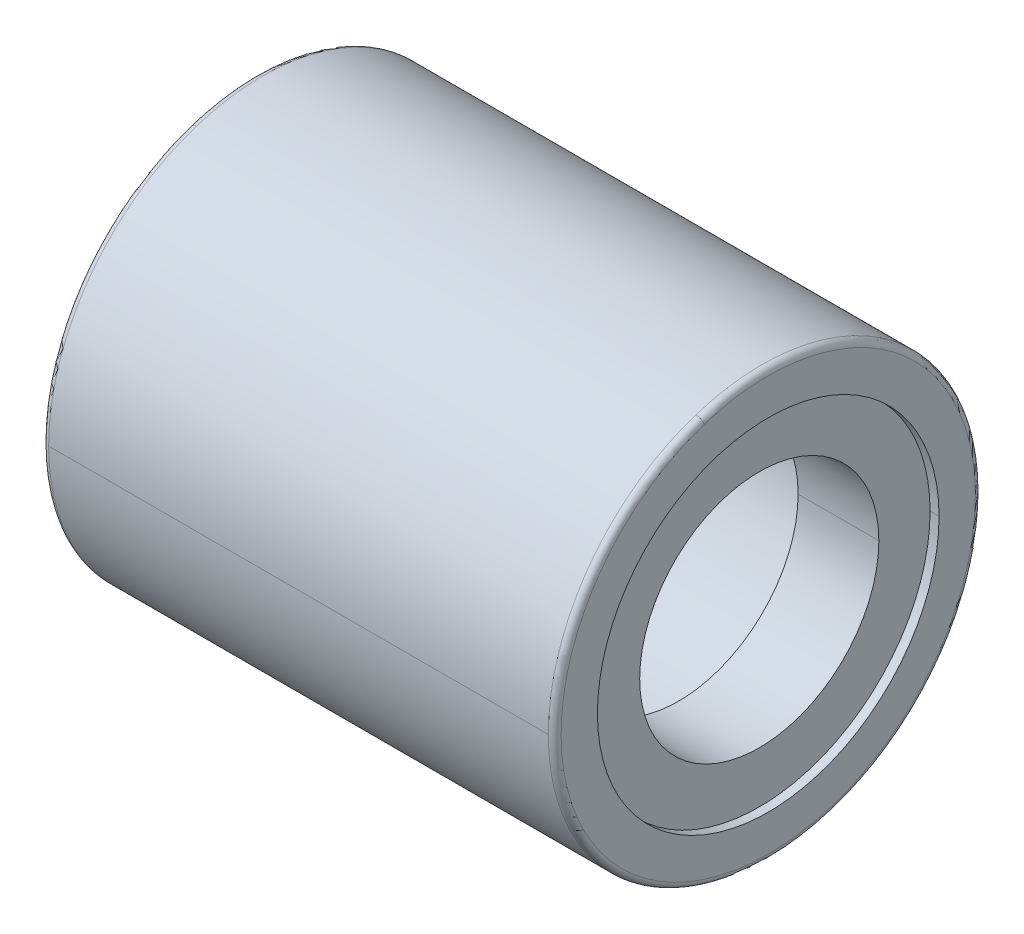
ISO-10303-21;
HEADER;
FILE_DESCRIPTION(('STEP AP214'),'2;1');
FILE_NAME('part.step','',(''),(''),'','','');
FILE_SCHEMA(('AUTOMOTIVE_DESIGN { 1 0 10303 214 1 1 1 1 }'));
ENDSEC;
DATA;
#1=APPLICATION_CONTEXT('core data for automotive mechanical design processes');
#2=APPLICATION_PROTOCOL_DEFINITION('international standard','automotive_design',2000,#1);
#3=PRODUCT_CONTEXT('',#1,'mechanical');
#4=PRODUCT('Part','Part','',(#3));
#5=PRODUCT_RELATED_PRODUCT_CATEGORY('part','',(#4));
#6=PRODUCT_DEFINITION_FORMATION('','',#4);
#7=PRODUCT_DEFINITION_CONTEXT('part definition',#1,'design');
#8=PRODUCT_DEFINITION('design','',#6,#7);
#9=PRODUCT_DEFINITION_SHAPE('','',#8);
#10=(LENGTH_UNIT() NAMED_UNIT(*) SI_UNIT(.MILLI.,.METRE.));
#11=(NAMED_UNIT(*) PLANE_ANGLE_UNIT() SI_UNIT($,.RADIAN.));
#12=(NAMED_UNIT(*) SI_UNIT($,.STERADIAN.) SOLID_ANGLE_UNIT());
#13=UNCERTAINTY_MEASURE_WITH_UNIT(LENGTH_MEASURE(1.E-05),#10,'distance_accuracy_value','');
#14=(GEOMETRIC_REPRESENTATION_CONTEXT(3) GLOBAL_UNCERTAINTY_ASSIGNED_CONTEXT((#13)) GLOBAL_UNIT_ASSIGNED_CONTEXT((#10,
#11,#12)) REPRESENTATION_CONTEXT('',''));
#15=CARTESIAN_POINT('',(0.,0.,0.));
#16=DIRECTION('',(0.,0.,1.));
#17=DIRECTION('',(1.,0.,0.));
#18=AXIS2_PLACEMENT_3D('',#15,#16,#17);
#19=CARTESIAN_POINT('',(50.,0.,0.));
#20=DIRECTION('',(1.,0.,0.));
#21=DIRECTION('',(0.,1.,0.));
#22=AXIS2_PLACEMENT_3D('',#19,#20,#21);
#23=CYLINDRICAL_SURFACE('',#22,4.);
#24=DIRECTION('',(1.,0.,0.));
#25=VECTOR('',#24,1.);
#26=CARTESIAN_POINT('',(2.1,0.,4.));
#27=LINE('',#26,#25);
#28=CARTESIAN_POINT('',(2.1,0.,4.));
#29=VERTEX_POINT('',#28);
#30=CARTESIAN_POINT('',(9.9,0.,4.));
#31=VERTEX_POINT('',#30);
#32=EDGE_CURVE('E10',#29,#31,#27,.T.);
#33=ORIENTED_EDGE('',*,*,#32,.T.);
#34=CARTESIAN_POINT('',(9.9,0.,0.));
#35=DIRECTION('',(1.,0.,0.));
#36=DIRECTION('',(0.,0.,-1.));
#37=AXIS2_PLACEMENT_3D('',#34,#35,#36);
#38=CIRCLE('',#37,4.);
#39=CARTESIAN_POINT('',(9.9,0.,-4.));
#40=VERTEX_POINT('',#39);
#41=EDGE_CURVE('E24',#31,#40,#38,.T.);
#42=ORIENTED_EDGE('',*,*,#41,.T.);
#43=DIRECTION('',(1.,0.,0.));
#44=VECTOR('',#43,1.);
#45=CARTESIAN_POINT('',(2.1,0.,-4.));
#46=LINE('',#45,#44);
#47=CARTESIAN_POINT('',(2.1,0.,-4.));
#48=VERTEX_POINT('',#47);
#49=EDGE_CURVE('E432',#48,#40,#46,.T.);
#50=ORIENTED_EDGE('',*,*,#49,.F.);
#51=CARTESIAN_POINT('',(2.1,0.,0.));
#52=DIRECTION('',(1.,0.,0.));
#53=DIRECTION('',(0.,0.,-1.));
#54=AXIS2_PLACEMENT_3D('',#51,#52,#53);
#55=CIRCLE('',#54,4.);
#56=EDGE_CURVE('E427',#29,#48,#55,.T.);
#57=ORIENTED_EDGE('',*,*,#56,.F.);
#58=EDGE_LOOP('',(#33,#42,#50,#57));
#59=FACE_BOUND('',#58,.T.);
#60=ADVANCED_FACE('F16',(#59),#23,.F.);
#61=CARTESIAN_POINT('',(2.1,2.8,0.));
#62=DIRECTION('',(1.,0.,0.));
#63=DIRECTION('',(0.,0.,-1.));
#64=AXIS2_PLACEMENT_3D('',#61,#62,#63);
#65=PLANE('',#64);
#66=CARTESIAN_POINT('',(2.1,0.,0.));
#67=DIRECTION('',(1.,0.,0.));
#68=DIRECTION('',(0.,0.,-1.));
#69=AXIS2_PLACEMENT_3D('',#66,#67,#68);
#70=CIRCLE('',#69,4.);
#71=EDGE_CURVE('E422',#48,#29,#70,.T.);
#72=ORIENTED_EDGE('',*,*,#71,.T.);
#73=ORIENTED_EDGE('',*,*,#56,.T.);
#74=EDGE_LOOP('',(#72,#73));
#75=FACE_BOUND('',#74,.T.);
#76=CARTESIAN_POINT('',(2.1,0.,0.));
#77=DIRECTION('',(1.,0.,0.));
#78=DIRECTION('',(0.,0.,-1.));
#79=AXIS2_PLACEMENT_3D('',#76,#77,#78);
#80=CIRCLE('',#79,2.8);
#81=CARTESIAN_POINT('',(2.1,0.,2.8));
#82=VERTEX_POINT('',#81);
#83=CARTESIAN_POINT('',(2.1,0.,-2.8));
#84=VERTEX_POINT('',#83);
#85=EDGE_CURVE('E417',#82,#84,#80,.T.);
#86=ORIENTED_EDGE('',*,*,#85,.F.);
#87=CARTESIAN_POINT('',(2.1,0.,0.));
#88=DIRECTION('',(1.,0.,0.));
#89=DIRECTION('',(0.,0.,-1.));
#90=AXIS2_PLACEMENT_3D('',#87,#88,#89);
#91=CIRCLE('',#90,2.8);
#92=EDGE_CURVE('E412',#84,#82,#91,.T.);
#93=ORIENTED_EDGE('',*,*,#92,.F.);
#94=EDGE_LOOP('',(#86,#93));
#95=FACE_BOUND('',#94,.T.);
#96=ADVANCED_FACE('F445',(#75,#95),#65,.T.);
#97=CARTESIAN_POINT('',(50.,0.,0.));
#98=DIRECTION('',(1.,0.,0.));
#99=DIRECTION('',(0.,-1.,0.));
#100=AXIS2_PLACEMENT_3D('',#97,#98,#99);
#101=CYLINDRICAL_SURFACE('',#100,2.8);
#102=DIRECTION('',(1.,0.,0.));
#103=VECTOR('',#102,1.);
#104=CARTESIAN_POINT('',(0.210000000000001,0.,2.8));
#105=LINE('',#104,#103);
#106=CARTESIAN_POINT('',(0.210000000000001,0.,2.8));
#107=VERTEX_POINT('',#106);
#108=EDGE_CURVE('E407',#107,#82,#105,.T.);
#109=ORIENTED_EDGE('',*,*,#108,.F.);
#110=CARTESIAN_POINT('',(0.21,0.,0.));
#111=DIRECTION('',(1.,0.,0.));
#112=DIRECTION('',(0.,0.,-1.));
#113=AXIS2_PLACEMENT_3D('',#110,#111,#112);
#114=CIRCLE('',#113,2.8);
#115=CARTESIAN_POINT('',(0.21,0.,-2.8));
#116=VERTEX_POINT('',#115);
#117=EDGE_CURVE('E402',#116,#107,#114,.T.);
#118=ORIENTED_EDGE('',*,*,#117,.F.);
#119=DIRECTION('',(1.,0.,0.));
#120=VECTOR('',#119,1.);
#121=CARTESIAN_POINT('',(0.210000000000001,0.,-2.8));
#122=LINE('',#121,#120);
#123=EDGE_CURVE('E397',#116,#84,#122,.T.);
#124=ORIENTED_EDGE('',*,*,#123,.T.);
#125=ORIENTED_EDGE('',*,*,#92,.T.);
#126=EDGE_LOOP('',(#109,#118,#124,#125));
#127=FACE_BOUND('',#126,.T.);
#128=ADVANCED_FACE('F448',(#127),#101,.F.);
#129=CARTESIAN_POINT('',(50.,0.,0.));
#130=DIRECTION('',(1.,0.,0.));
#131=DIRECTION('',(0.,1.,0.));
#132=AXIS2_PLACEMENT_3D('',#129,#130,#131);
#133=CYLINDRICAL_SURFACE('',#132,2.8);
#134=ORIENTED_EDGE('',*,*,#108,.T.);
#135=ORIENTED_EDGE('',*,*,#85,.T.);
#136=ORIENTED_EDGE('',*,*,#123,.F.);
#137=CARTESIAN_POINT('',(0.21,0.,0.));
#138=DIRECTION('',(1.,0.,0.));
#139=DIRECTION('',(0.,0.,-1.));
#140=AXIS2_PLACEMENT_3D('',#137,#138,#139);
#141=CIRCLE('',#140,2.8);
#142=EDGE_CURVE('E392',#107,#116,#141,.T.);
#143=ORIENTED_EDGE('',*,*,#142,.F.);
#144=EDGE_LOOP('',(#134,#135,#136,#143));
#145=FACE_BOUND('',#144,.T.);
#146=ADVANCED_FACE('F452',(#145),#133,.F.);
#147=CARTESIAN_POINT('',(0.21,4.,0.));
#148=DIRECTION('',(-1.,0.,0.));
#149=DIRECTION('',(0.,0.,1.));
#150=AXIS2_PLACEMENT_3D('',#147,#148,#149);
#151=PLANE('',#150);
#152=ORIENTED_EDGE('',*,*,#117,.T.);
#153=ORIENTED_EDGE('',*,*,#142,.T.);
#154=EDGE_LOOP('',(#152,#153));
#155=FACE_BOUND('',#154,.T.);
#156=CARTESIAN_POINT('',(0.21,0.,0.));
#157=DIRECTION('',(1.,0.,0.));
#158=DIRECTION('',(0.,0.,-1.));
#159=AXIS2_PLACEMENT_3D('',#156,#157,#158);
#160=CIRCLE('',#159,4.);
#161=CARTESIAN_POINT('',(0.210000000000001,0.,4.));
#162=VERTEX_POINT('',#161);
#163=CARTESIAN_POINT('',(0.21,0.,-4.));
#164=VERTEX_POINT('',#163);
#165=EDGE_CURVE('E387',#162,#164,#160,.T.);
#166=ORIENTED_EDGE('',*,*,#165,.F.);
#167=CARTESIAN_POINT('',(0.21,0.,0.));
#168=DIRECTION('',(1.,0.,0.));
#169=DIRECTION('',(0.,0.,-1.));
#170=AXIS2_PLACEMENT_3D('',#167,#168,#169);
#171=CIRCLE('',#170,4.);
#172=EDGE_CURVE('E382',#164,#162,#171,.T.);
#173=ORIENTED_EDGE('',*,*,#172,.F.);
#174=EDGE_LOOP('',(#166,#173));
#175=FACE_BOUND('',#174,.T.);
#176=ADVANCED_FACE('F455',(#155,#175),#151,.T.);
#177=CARTESIAN_POINT('',(50.,0.,0.));
#178=DIRECTION('',(1.,0.,0.));
#179=DIRECTION('',(0.,-1.,0.));
#180=AXIS2_PLACEMENT_3D('',#177,#178,#179);
#181=CYLINDRICAL_SURFACE('',#180,4.);
#182=DIRECTION('',(1.,0.,0.));
#183=VECTOR('',#182,1.);
#184=CARTESIAN_POINT('',(0.,0.,4.));
#185=LINE('',#184,#183);
#186=CARTESIAN_POINT('',(0.,0.,4.));
#187=VERTEX_POINT('',#186);
#188=EDGE_CURVE('E377',#187,#162,#185,.T.);
#189=ORIENTED_EDGE('',*,*,#188,.F.);
#190=CARTESIAN_POINT('',(0.,0.,0.));
#191=DIRECTION('',(1.,0.,0.));
#192=DIRECTION('',(0.,0.,-1.));
#193=AXIS2_PLACEMENT_3D('',#190,#191,#192);
#194=CIRCLE('',#193,4.);
#195=CARTESIAN_POINT('',(0.,0.,-4.));
#196=VERTEX_POINT('',#195);
#197=EDGE_CURVE('E372',#196,#187,#194,.T.);
#198=ORIENTED_EDGE('',*,*,#197,.F.);
#199=DIRECTION('',(1.,0.,0.));
#200=VECTOR('',#199,1.);
#201=CARTESIAN_POINT('',(0.,0.,-4.));
#202=LINE('',#201,#200);
#203=EDGE_CURVE('E367',#196,#164,#202,.T.);
#204=ORIENTED_EDGE('',*,*,#203,.T.);
#205=ORIENTED_EDGE('',*,*,#172,.T.);
#206=EDGE_LOOP('',(#189,#198,#204,#205));
#207=FACE_BOUND('',#206,.T.);
#208=ADVANCED_FACE('F458',(#207),#181,.F.);
#209=CARTESIAN_POINT('',(50.,0.,0.));
#210=DIRECTION('',(1.,0.,0.));
#211=DIRECTION('',(0.,1.,0.));
#212=AXIS2_PLACEMENT_3D('',#209,#210,#211);
#213=CYLINDRICAL_SURFACE('',#212,4.);
#214=ORIENTED_EDGE('',*,*,#188,.T.);
#215=ORIENTED_EDGE('',*,*,#165,.T.);
#216=ORIENTED_EDGE('',*,*,#203,.F.);
#217=CARTESIAN_POINT('',(0.,0.,0.));
#218=DIRECTION('',(1.,0.,0.));
#219=DIRECTION('',(0.,0.,-1.));
#220=AXIS2_PLACEMENT_3D('',#217,#218,#219);
#221=CIRCLE('',#220,4.);
#222=EDGE_CURVE('E364',#187,#196,#221,.T.);
#223=ORIENTED_EDGE('',*,*,#222,.F.);
#224=EDGE_LOOP('',(#214,#215,#216,#223));
#225=FACE_BOUND('',#224,.T.);
#226=ADVANCED_FACE('F463',(#225),#213,.F.);
#227=CARTESIAN_POINT('',(0.,4.85,0.));
#228=DIRECTION('',(-1.,0.,0.));
#229=DIRECTION('',(0.,0.,1.));
#230=AXIS2_PLACEMENT_3D('',#227,#228,#229);
#231=PLANE('',#230);
#232=ORIENTED_EDGE('',*,*,#197,.T.);
#233=ORIENTED_EDGE('',*,*,#222,.T.);
#234=EDGE_LOOP('',(#232,#233));
#235=FACE_BOUND('',#234,.T.);
#236=CARTESIAN_POINT('',(0.,-4.61262410403149,-1.49873242271851));
#237=CARTESIAN_POINT('',(0.,-4.58810272833592,-1.57420690453958));
#238=CARTESIAN_POINT('',(0.,-4.5617258440753,-1.64907834447075));
#239=CARTESIAN_POINT('',(0.,-4.50533151965913,-1.79743739794931));
#240=CARTESIAN_POINT('',(0.,-4.47531407950357,-1.87092501149671));
#241=CARTESIAN_POINT('',(0.,-4.41170910453264,-2.01633866960378));
#242=CARTESIAN_POINT('',(0.,-4.37812156971728,-2.08826471416345));
#243=CARTESIAN_POINT('',(0.,-4.30745781735907,-2.23038214692561));
#244=CARTESIAN_POINT('',(0.,-4.27038159981622,-2.30057353512809));
#245=CARTESIAN_POINT('',(0.,-4.19282966878991,-2.43905250739239));
#246=CARTESIAN_POINT('',(0.,-4.15235395530645,-2.5073400914542));
#247=CARTESIAN_POINT('',(0.,-4.06810057759361,-2.64184695821906));
#248=CARTESIAN_POINT('',(0.,-4.02432291336423,-2.70806624092212));
#249=CARTESIAN_POINT('',(0.,-3.93357108883324,-2.83827697328574));
#250=CARTESIAN_POINT('',(0.,-3.88659692853163,-2.90226842294631));
#251=CARTESIAN_POINT('',(0.,-3.78956527928276,-3.02786932919082));
#252=CARTESIAN_POINT('',(0.,-3.7395077903355,-3.08947878577477));
#253=CARTESIAN_POINT('',(0.,-3.63643007598479,-3.21016728302803));
#254=CARTESIAN_POINT('',(0.,-3.58340985058133,-3.26924632369735));
#255=CARTESIAN_POINT('',(0.,-3.47453439386903,-3.38473166260754));
#256=CARTESIAN_POINT('',(0.,-3.4186791625602,-3.44113796084841));
#257=CARTESIAN_POINT('',(0.,-3.30426825413246,-3.55114192716992));
#258=CARTESIAN_POINT('',(0.,-3.24571257701356,-3.60473959525055));
#259=CARTESIAN_POINT('',(0.,-3.12604184273393,-3.70899717977959));
#260=CARTESIAN_POINT('',(0.,-3.06492678557321,-3.759657096228));
#261=CARTESIAN_POINT('',(0.,-2.94028452273217,-3.85791713331523));
#262=CARTESIAN_POINT('',(0.,-2.87675731705184,-3.90551725395406));
#263=CARTESIAN_POINT('',(0.,-2.74744379977533,-3.9975430265626));
#264=CARTESIAN_POINT('',(0.,-2.68165748817916,-4.0419686785323));
#265=CARTESIAN_POINT('',(0.,-2.54798424405754,-4.12753848851568));
#266=CARTESIAN_POINT('',(0.,-2.48009731153209,-4.16868264652935));
#267=CARTESIAN_POINT('',(0.,-2.34238637111865,-4.24759034872023));
#268=CARTESIAN_POINT('',(0.,-2.27256236323065,-4.28535389289743));
#269=CARTESIAN_POINT('',(0.,-2.13114548424295,-4.35740939172974));
#270=CARTESIAN_POINT('',(0.,-2.05955261314324,-4.39170134638485));
#271=CARTESIAN_POINT('',(0.,-1.9147704812294,-4.45673105385059));
#272=CARTESIAN_POINT('',(0.,-1.84158122041526,-4.48746880666122));
#273=CARTESIAN_POINT('',(0.,-1.69378262841248,-4.54531606049918));
#274=CARTESIAN_POINT('',(0.,-1.61917329722384,-4.5724255615265));
#275=CARTESIAN_POINT('',(0.,-1.46871430488589,-4.62295100263535));
#276=CARTESIAN_POINT('',(0.,-1.39286464373657,-4.64636694271688));
#277=CARTESIAN_POINT('',(0.,-1.24010771995464,-4.6894488508835));
#278=CARTESIAN_POINT('',(0.,-1.16320045732201,-4.70911481896858));
#279=CARTESIAN_POINT('',(0.,-1.00851360690541,-4.74464940610266));
#280=CARTESIAN_POINT('',(0.,-0.930734019121438,-4.76051802515164));
#281=CARTESIAN_POINT('',(0.,-0.774489896241795,-4.78841968532031));
#282=CARTESIAN_POINT('',(0.,-0.696025361146128,-4.80045272643998));
#283=CARTESIAN_POINT('',(0.,-0.538600371580827,-4.82065424209999));
#284=CARTESIAN_POINT('',(0.,-0.459639917111194,-4.82882271664033));
#285=CARTESIAN_POINT('',(0.,-0.301413311448898,-4.84127542057101));
#286=CARTESIAN_POINT('',(0.,-0.222147160256235,-4.84555964996137));
#287=CARTESIAN_POINT('',(0.,-0.0635001202490007,-4.85023354250824));
#288=CARTESIAN_POINT('',(0.,0.0158807685655711,-4.85062320566475));
#289=CARTESIAN_POINT('',(0.,0.174566048302527,-4.84750702701128));
#290=CARTESIAN_POINT('',(0.,0.253870439224911,-4.84400118520128));
#291=CARTESIAN_POINT('',(0.,0.412211671953515,-4.83310244249477));
#292=CARTESIAN_POINT('',(0.,0.491248513759735,-4.82570954159826));
#293=CARTESIAN_POINT('',(0.,0.648864241581289,-4.80705449086452));
#294=CARTESIAN_POINT('',(0.,0.727443127596624,-4.7957923410273));
#295=CARTESIAN_POINT('',(0.,0.8839536404173,-4.76942592391754));
#296=CARTESIAN_POINT('',(0.,0.961885267222641,-4.754321656645));
#297=CARTESIAN_POINT('',(0.,1.11691351750835,-4.72030739216746));
#298=CARTESIAN_POINT('',(0.,1.19401014098872,-4.70139739496245));
#299=CARTESIAN_POINT('',(0.,1.34718265210565,-4.65981722645956));
#300=CARTESIAN_POINT('',(0.,1.42325853974222,-4.63714705516166));
#301=CARTESIAN_POINT('',(0.,1.57420630569477,-4.58810115290133));
#302=CARTESIAN_POINT('',(0.,1.64907818401075,-4.56172542193888));
#303=CARTESIAN_POINT('',(0.,1.79743755840928,-4.50533194179556));
#304=CARTESIAN_POINT('',(0.,1.87092505449182,-4.47531419261469));
#305=CARTESIAN_POINT('',(0.,2.01633862660865,-4.41170899142153));
#306=CARTESIAN_POINT('',(0.,2.08826470264293,-4.37812153940926));
#307=CARTESIAN_POINT('',(0.,2.23038215844611,-4.30745784766711));
#308=CARTESIAN_POINT('',(0.,2.30057353821499,-4.27038160793723));
#309=CARTESIAN_POINT('',(0.,2.43905250430547,-4.1928296606689));
#310=CARTESIAN_POINT('',(0.,2.50734009062705,-4.15235395313044));
#311=CARTESIAN_POINT('',(0.,2.64184695904618,-4.06810057976964));
#312=CARTESIAN_POINT('',(0.,2.70806624114373,-4.0243229139473));
#313=CARTESIAN_POINT('',(0.,2.8382769730641,-3.93357108825019));
#314=CARTESIAN_POINT('',(0.,2.90226842288691,-3.88659692837541));
#315=CARTESIAN_POINT('',(0.,3.0278693292502,-3.789565279439));
#316=CARTESIAN_POINT('',(0.,3.08947878579067,-3.73950779037737));
#317=CARTESIAN_POINT('',(0.,3.21016728301211,-3.63643007594293));
#318=CARTESIAN_POINT('',(0.,3.26924632369307,-3.58340985057012));
#319=CARTESIAN_POINT('',(0.,3.38473166261179,-3.47453439388026));
#320=CARTESIAN_POINT('',(0.,3.44113796084954,-3.41867916256321));
#321=CARTESIAN_POINT('',(0.,3.55114192716876,-3.30426825412946));
#322=CARTESIAN_POINT('',(0.,3.60473959525024,-3.24571257701276));
#323=CARTESIAN_POINT('',(0.,3.70899717977989,-3.12604184273475));
#324=CARTESIAN_POINT('',(0.,3.75965709622808,-3.06492678557344));
#325=CARTESIAN_POINT('',(0.,3.85791713331514,-2.94028452273196));
#326=CARTESIAN_POINT('',(0.,3.90551725395403,-2.87675731705179));
#327=CARTESIAN_POINT('',(0.,3.99754302656261,-2.7474437997754));
#328=CARTESIAN_POINT('',(0.,4.0419686785323,-2.68165748817918));
#329=CARTESIAN_POINT('',(0.,4.12753848851567,-2.54798424405753));
#330=CARTESIAN_POINT('',(0.,4.16868264652935,-2.4800973115321));
#331=CARTESIAN_POINT('',(0.,4.24759034872022,-2.34238637111866));
#332=CARTESIAN_POINT('',(0.,4.28535389289743,-2.27256236323066));
#333=CARTESIAN_POINT('',(0.,4.35740939172974,-2.13114548424296));
#334=CARTESIAN_POINT('',(0.,4.39170134638484,-2.05955261314325));
#335=CARTESIAN_POINT('',(0.,4.45673105385059,-1.91477048122941));
#336=CARTESIAN_POINT('',(0.,4.48746880666123,-1.84158122041527));
#337=CARTESIAN_POINT('',(0.,4.54531606049916,-1.6937826284125));
#338=CARTESIAN_POINT('',(0.,4.57242556152644,-1.61917329722387));
#339=CARTESIAN_POINT('',(0.,4.62295100263541,-1.46871430488588));
#340=CARTESIAN_POINT('',(0.,4.6463669427171,-1.39286464373653));
#341=CARTESIAN_POINT('',(0.,4.68944885088327,-1.24010771995471));
#342=CARTESIAN_POINT('',(0.,4.70911481896775,-1.16320045732225));
#343=CARTESIAN_POINT('',(0.,4.74464940610348,-1.0085136069052));
#344=CARTESIAN_POINT('',(0.,4.76051802515474,-0.930734019120609));
#345=CARTESIAN_POINT('',(0.,4.7884196853172,-0.774489896242651));
#346=CARTESIAN_POINT('',(0.,4.8004527264284,-0.696025361149284));
#347=CARTESIAN_POINT('',(0.,4.82065424211157,-0.538600371577697));
#348=CARTESIAN_POINT('',(0.,4.82882271668355,-0.459639917099475));
#349=CARTESIAN_POINT('',(0.,4.84127542052779,-0.301413311460646));
#350=CARTESIAN_POINT('',(0.,4.84555964980007,-0.222147160300038));
#351=CARTESIAN_POINT('',(0.,4.85023354266954,-0.0635001202052311));
#352=CARTESIAN_POINT('',(0.,4.85062320626673,0.0158807687289677));
#353=CARTESIAN_POINT('',(0.,4.8475070264093,0.174566048139099));
#354=CARTESIAN_POINT('',(0.,4.84400118295467,0.253870438615031));
#355=CARTESIAN_POINT('',(0.,4.83310244474139,0.412211672563367));
#356=CARTESIAN_POINT('',(0.,4.82570954998274,0.491248516035771));
#357=CARTESIAN_POINT('',(0.,4.80705448248005,0.64886423930523));
#358=CARTESIAN_POINT('',(0.,4.795792309736,0.727443119102286));
#359=CARTESIAN_POINT('',(0.,4.76942595520884,0.883953648911615));
#360=CARTESIAN_POINT('',(0.,4.75432177342572,0.96188529892389));
#361=CARTESIAN_POINT('',(0.,4.72030727538675,1.11691348580708));
#362=CARTESIAN_POINT('',(0.,4.7013969591309,1.19401002267799));
#363=CARTESIAN_POINT('',(0.,4.65981766229111,1.34718277041636));
#364=CARTESIAN_POINT('',(0.,4.63714868170717,1.42325898128381));
#365=CARTESIAN_POINT('',(0.,4.6126241040315,1.49873242271848));
#366=B_SPLINE_CURVE_WITH_KNOTS('',3,(#236,#237,#238,#239,#240,#241,#242,#243,#244,#245,#246,
#247,#248,#249,#250,#251,#252,#253,#254,#255,#256,#257,#258,#259,#260,#261,#262,#263,#264,#265,
#266,#267,#268,#269,#270,#271,#272,#273,#274,#275,#276,#277,#278,#279,#280,#281,#282,#283,#284,
#285,#286,#287,#288,#289,#290,#291,#292,#293,#294,#295,#296,#297,#298,#299,#300,#301,#302,#303,
#304,#305,#306,#307,#308,#309,#310,#311,#312,#313,#314,#315,#316,#317,#318,#319,#320,#321,#322,
#323,#324,#325,#326,#327,#328,#329,#330,#331,#332,#333,#334,#335,#336,#337,#338,#339,#340,#341,
#342,#343,#344,#345,#346,#347,#348,#349,#350,#351,#352,#353,#354,#355,#356,#357,#358,#359,#360,
#361,#362,#363,#364,#365),.UNSPECIFIED.,.F.,.F.,(4,2,2,2,2,2,2,2,2,2,2,2,2,2,2,2,2,2,2,2,2,2,2,
2,2,2,2,2,2,2,2,2,2,2,2,2,2,2,2,2,2,2,2,2,2,2,2,2,2,2,2,2,2,2,2,2,2,2,2,2,2,2,2,2,4),(0.,
0.238049916672248,0.476099833344498,0.714149750016746,0.952199666688996,1.19024958336124,
1.42829950003349,1.66634941670574,1.90439933337799,2.14244925005024,2.38049916672249,
2.61854908339474,2.85659900006699,3.09464891673923,3.33269883341148,3.57074875008373,
3.80879866675598,4.04684858342823,4.28489850010048,4.52294841677273,4.76099833344498,
4.99904825011722,5.23709816678947,5.47514808346172,5.71319800013397,5.95124791680622,
6.18929783347847,6.42734775015072,6.66539766682296,6.90344758349521,7.14149750016746,
7.37954741683971,7.61759733351196,7.85564725018421,8.09369716685646,8.33174708352871,
8.56979700020096,8.8078469168732,9.04589683354545,9.2839467502177,9.52199666688995,
9.7600465835622,9.99809650023445,10.2361464169067,10.4741963335789,10.7122462502512,
10.9502961669234,11.1883460835957,11.4263960002679,11.6644459169402,11.9024958336124,
12.1405457502847,12.3785956669569,12.6166455836292,12.8546955003014,13.0927454169737,
13.3307953336459,13.5688452503182,13.8068951669904,14.0449450836627,14.2829950003349,
14.5210449170072,14.7590948336794,14.9971447503517,15.2351946670239),.UNSPECIFIED.);
#367=CARTESIAN_POINT('',(0.,-4.6126241040315,-1.49873242271849));
#368=VERTEX_POINT('',#367);
#369=CARTESIAN_POINT('',(0.,4.6126241040315,1.49873242271849));
#370=VERTEX_POINT('',#369);
#371=EDGE_CURVE('E363',#368,#370,#366,.T.);
#372=ORIENTED_EDGE('',*,*,#371,.F.);
#373=CARTESIAN_POINT('',(0.,4.61262410403149,1.49873242271851));
#374=CARTESIAN_POINT('',(0.,4.58810272833592,1.57420690453958));
#375=CARTESIAN_POINT('',(0.,4.5617258440753,1.64907834447075));
#376=CARTESIAN_POINT('',(0.,4.50533151965913,1.79743739794931));
#377=CARTESIAN_POINT('',(0.,4.47531407950357,1.87092501149671));
#378=CARTESIAN_POINT('',(0.,4.41170910453264,2.01633866960378));
#379=CARTESIAN_POINT('',(0.,4.37812156971728,2.08826471416345));
#380=CARTESIAN_POINT('',(0.,4.30745781735907,2.23038214692561));
#381=CARTESIAN_POINT('',(0.,4.27038159981621,2.3005735351281));
#382=CARTESIAN_POINT('',(0.,4.19282966878991,2.43905250739239));
#383=CARTESIAN_POINT('',(0.,4.15235395530645,2.5073400914542));
#384=CARTESIAN_POINT('',(0.,4.06810057759361,2.64184695821906));
#385=CARTESIAN_POINT('',(0.,4.02432291336423,2.70806624092212));
#386=CARTESIAN_POINT('',(0.,3.93357108883324,2.83827697328574));
#387=CARTESIAN_POINT('',(0.,3.88659692853163,2.90226842294631));
#388=CARTESIAN_POINT('',(0.,3.78956527928276,3.02786932919083));
#389=CARTESIAN_POINT('',(0.,3.7395077903355,3.08947878577477));
#390=CARTESIAN_POINT('',(0.,3.63643007598478,3.21016728302803));
#391=CARTESIAN_POINT('',(0.,3.58340985058133,3.26924632369735));
#392=CARTESIAN_POINT('',(0.,3.47453439386903,3.38473166260754));
#393=CARTESIAN_POINT('',(0.,3.4186791625602,3.44113796084841));
#394=CARTESIAN_POINT('',(0.,3.30426825413246,3.55114192716992));
#395=CARTESIAN_POINT('',(0.,3.24571257701355,3.60473959525055));
#396=CARTESIAN_POINT('',(0.,3.12604184273393,3.7089971797796));
#397=CARTESIAN_POINT('',(0.,3.06492678557321,3.759657096228));
#398=CARTESIAN_POINT('',(0.,2.94028452273216,3.85791713331524));
#399=CARTESIAN_POINT('',(0.,2.87675731705184,3.90551725395406));
#400=CARTESIAN_POINT('',(0.,2.74744379977533,3.9975430265626));
#401=CARTESIAN_POINT('',(0.,2.68165748817915,4.04196867853231));
#402=CARTESIAN_POINT('',(0.,2.54798424405753,4.12753848851569));
#403=CARTESIAN_POINT('',(0.,2.48009731153209,4.16868264652936));
#404=CARTESIAN_POINT('',(0.,2.34238637111864,4.24759034872023));
#405=CARTESIAN_POINT('',(0.,2.27256236323065,4.28535389289743));
#406=CARTESIAN_POINT('',(0.,2.13114548424294,4.35740939172974));
#407=CARTESIAN_POINT('',(0.,2.05955261314323,4.39170134638485));
#408=CARTESIAN_POINT('',(0.,1.91477048122939,4.45673105385059));
#409=CARTESIAN_POINT('',(0.,1.84158122041526,4.48746880666122));
#410=CARTESIAN_POINT('',(0.,1.69378262841248,4.54531606049918));
#411=CARTESIAN_POINT('',(0.,1.61917329722383,4.5724255615265));
#412=CARTESIAN_POINT('',(0.,1.46871430488588,4.62295100263536));
#413=CARTESIAN_POINT('',(0.,1.39286464373657,4.64636694271689));
#414=CARTESIAN_POINT('',(0.,1.24010771995463,4.6894488508835));
#415=CARTESIAN_POINT('',(0.,1.16320045732201,4.70911481896858));
#416=CARTESIAN_POINT('',(0.,1.00851360690541,4.74464940610266));
#417=CARTESIAN_POINT('',(0.,0.930734019121432,4.76051802515164));
#418=CARTESIAN_POINT('',(0.,0.774489896241788,4.78841968532031));
#419=CARTESIAN_POINT('',(0.,0.696025361146121,4.80045272643998));
#420=CARTESIAN_POINT('',(0.,0.53860037158082,4.82065424209999));
#421=CARTESIAN_POINT('',(0.,0.459639917111187,4.82882271664033));
#422=CARTESIAN_POINT('',(0.,0.301413311448892,4.84127542057102));
#423=CARTESIAN_POINT('',(0.,0.22214716025623,4.84555964996137));
#424=CARTESIAN_POINT('',(0.,0.0635001202489951,4.85023354250824));
#425=CARTESIAN_POINT('',(0.,-0.0158807685655774,4.85062320566475));
#426=CARTESIAN_POINT('',(0.,-0.174566048302534,4.84750702701127));
#427=CARTESIAN_POINT('',(0.,-0.253870439224918,4.84400118520128));
#428=CARTESIAN_POINT('',(0.,-0.412211671953523,4.83310244249477));
#429=CARTESIAN_POINT('',(0.,-0.491248513759744,4.82570954159826));
#430=CARTESIAN_POINT('',(0.,-0.648864241581299,4.80705449086452));
#431=CARTESIAN_POINT('',(0.,-0.727443127596633,4.7957923410273));
#432=CARTESIAN_POINT('',(0.,-0.883953640417309,4.76942592391754));
#433=CARTESIAN_POINT('',(0.,-0.96188526722265,4.754321656645));
#434=CARTESIAN_POINT('',(0.,-1.11691351750836,4.72030739216746));
#435=CARTESIAN_POINT('',(0.,-1.19401014098873,4.70139739496245));
#436=CARTESIAN_POINT('',(0.,-1.34718265210566,4.65981722645955));
#437=CARTESIAN_POINT('',(0.,-1.42325853974223,4.63714705516166));
#438=CARTESIAN_POINT('',(0.,-1.57420630569478,4.58810115290132));
#439=CARTESIAN_POINT('',(0.,-1.64907818401076,4.56172542193888));
#440=CARTESIAN_POINT('',(0.,-1.79743755840929,4.50533194179556));
#441=CARTESIAN_POINT('',(0.,-1.87092505449183,4.47531419261468));
#442=CARTESIAN_POINT('',(0.,-2.01633862660865,4.41170899142153));
#443=CARTESIAN_POINT('',(0.,-2.08826470264294,4.37812153940925));
#444=CARTESIAN_POINT('',(0.,-2.23038215844611,4.3074578476671));
#445=CARTESIAN_POINT('',(0.,-2.300573538215,4.27038160793723));
#446=CARTESIAN_POINT('',(0.,-2.43905250430547,4.1928296606689));
#447=CARTESIAN_POINT('',(0.,-2.50734009062706,4.15235395313043));
#448=CARTESIAN_POINT('',(0.,-2.64184695904619,4.06810057976963));
#449=CARTESIAN_POINT('',(0.,-2.70806624114374,4.02432291394729));
#450=CARTESIAN_POINT('',(0.,-2.83827697306411,3.93357108825018));
#451=CARTESIAN_POINT('',(0.,-2.90226842288692,3.8865969283754));
#452=CARTESIAN_POINT('',(0.,-3.02786932925021,3.789565279439));
#453=CARTESIAN_POINT('',(0.,-3.08947878579068,3.73950779037737));
#454=CARTESIAN_POINT('',(0.,-3.21016728301211,3.63643007594293));
#455=CARTESIAN_POINT('',(0.,-3.26924632369308,3.58340985057011));
#456=CARTESIAN_POINT('',(0.,-3.3847316626118,3.47453439388025));
#457=CARTESIAN_POINT('',(0.,-3.44113796084955,3.41867916256321));
#458=CARTESIAN_POINT('',(0.,-3.55114192716877,3.30426825412945));
#459=CARTESIAN_POINT('',(0.,-3.60473959525024,3.24571257701275));
#460=CARTESIAN_POINT('',(0.,-3.7089971797799,3.12604184273474));
#461=CARTESIAN_POINT('',(0.,-3.75965709622808,3.06492678557343));
#462=CARTESIAN_POINT('',(0.,-3.85791713331515,2.94028452273195));
#463=CARTESIAN_POINT('',(0.,-3.90551725395404,2.87675731705178));
#464=CARTESIAN_POINT('',(0.,-3.99754302656262,2.74744379977539));
#465=CARTESIAN_POINT('',(0.,-4.04196867853231,2.68165748817917));
#466=CARTESIAN_POINT('',(0.,-4.12753848851568,2.54798424405752));
#467=CARTESIAN_POINT('',(0.,-4.16868264652935,2.48009731153209));
#468=CARTESIAN_POINT('',(0.,-4.24759034872023,2.34238637111865));
#469=CARTESIAN_POINT('',(0.,-4.28535389289743,2.27256236323065));
#470=CARTESIAN_POINT('',(0.,-4.35740939172974,2.13114548424295));
#471=CARTESIAN_POINT('',(0.,-4.39170134638485,2.05955261314324));
#472=CARTESIAN_POINT('',(0.,-4.4567310538506,1.91477048122939));
#473=CARTESIAN_POINT('',(0.,-4.48746880666124,1.84158122041526));
#474=CARTESIAN_POINT('',(0.,-4.54531606049916,1.69378262841249));
#475=CARTESIAN_POINT('',(0.,-4.57242556152644,1.61917329722385));
#476=CARTESIAN_POINT('',(0.,-4.62295100263541,1.46871430488587));
#477=CARTESIAN_POINT('',(0.,-4.64636694271711,1.39286464373651));
#478=CARTESIAN_POINT('',(0.,-4.68944885088328,1.2401077199547));
#479=CARTESIAN_POINT('',(0.,-4.70911481896775,1.16320045732224));
#480=CARTESIAN_POINT('',(0.,-4.74464940610349,1.00851360690519));
#481=CARTESIAN_POINT('',(0.,-4.76051802515475,0.930734019120596));
#482=CARTESIAN_POINT('',(0.,-4.7884196853172,0.774489896242636));
#483=CARTESIAN_POINT('',(0.,-4.8004527264284,0.696025361149268));
#484=CARTESIAN_POINT('',(0.,-4.82065424211157,0.538600371577679));
#485=CARTESIAN_POINT('',(0.,-4.82882271668355,0.459639917099457));
#486=CARTESIAN_POINT('',(0.,-4.8412754205278,0.301413311460628));
#487=CARTESIAN_POINT('',(0.,-4.84555964980007,0.22214716030002));
#488=CARTESIAN_POINT('',(0.,-4.85023354266954,0.0635001202052134));
#489=CARTESIAN_POINT('',(0.,-4.85062320626673,-0.0158807687289856));
#490=CARTESIAN_POINT('',(0.,-4.8475070264093,-0.174566048139116));
#491=CARTESIAN_POINT('',(0.,-4.84400118295467,-0.253870438615048));
#492=CARTESIAN_POINT('',(0.,-4.83310244474139,-0.412211672563385));
#493=CARTESIAN_POINT('',(0.,-4.82570954998274,-0.491248516035789));
#494=CARTESIAN_POINT('',(0.,-4.80705448248005,-0.648864239305248));
#495=CARTESIAN_POINT('',(0.,-4.795792309736,-0.727443119102303));
#496=CARTESIAN_POINT('',(0.,-4.76942595520883,-0.883953648911633));
#497=CARTESIAN_POINT('',(0.,-4.75432177342571,-0.961885298923907));
#498=CARTESIAN_POINT('',(0.,-4.72030727538675,-1.11691348580709));
#499=CARTESIAN_POINT('',(0.,-4.7013969591309,-1.19401002267801));
#500=CARTESIAN_POINT('',(0.,-4.65981766229111,-1.34718277041637));
#501=CARTESIAN_POINT('',(0.,-4.63714868170717,-1.42325898128383));
#502=CARTESIAN_POINT('',(0.,-4.61262410403149,-1.4987324227185));
#503=B_SPLINE_CURVE_WITH_KNOTS('',3,(#373,#374,#375,#376,#377,#378,#379,#380,#381,#382,#383,
#384,#385,#386,#387,#388,#389,#390,#391,#392,#393,#394,#395,#396,#397,#398,#399,#400,#401,#402,
#403,#404,#405,#406,#407,#408,#409,#410,#411,#412,#413,#414,#415,#416,#417,#418,#419,#420,#421,
#422,#423,#424,#425,#426,#427,#428,#429,#430,#431,#432,#433,#434,#435,#436,#437,#438,#439,#440,
#441,#442,#443,#444,#445,#446,#447,#448,#449,#450,#451,#452,#453,#454,#455,#456,#457,#458,#459,
#460,#461,#462,#463,#464,#465,#466,#467,#468,#469,#470,#471,#472,#473,#474,#475,#476,#477,#478,
#479,#480,#481,#482,#483,#484,#485,#486,#487,#488,#489,#490,#491,#492,#493,#494,#495,#496,#497,
#498,#499,#500,#501,#502),.UNSPECIFIED.,.F.,.F.,(4,2,2,2,2,2,2,2,2,2,2,2,2,2,2,2,2,2,2,2,2,2,2,
2,2,2,2,2,2,2,2,2,2,2,2,2,2,2,2,2,2,2,2,2,2,2,2,2,2,2,2,2,2,2,2,2,2,2,2,2,2,2,2,2,4),(0.,
0.238049916672248,0.476099833344498,0.714149750016747,0.952199666688996,1.19024958336125,
1.42829950003349,1.66634941670574,1.90439933337799,2.14244925005024,2.38049916672249,
2.61854908339474,2.85659900006699,3.09464891673924,3.33269883341149,3.57074875008374,
3.80879866675598,4.04684858342823,4.28489850010048,4.52294841677273,4.76099833344498,
4.99904825011723,5.23709816678948,5.47514808346173,5.71319800013398,5.95124791680623,
6.18929783347847,6.42734775015072,6.66539766682297,6.90344758349522,7.14149750016747,
7.37954741683972,7.61759733351197,7.85564725018422,8.09369716685647,8.33174708352872,
8.56979700020097,8.80784691687322,9.04589683354546,9.28394675021771,9.52199666688997,
9.76004658356221,9.99809650023446,10.2361464169067,10.474196333579,10.7122462502512,
10.9502961669235,11.1883460835957,11.426396000268,11.6644459169402,11.9024958336125,
12.1405457502847,12.378595666957,12.6166455836292,12.8546955003015,13.0927454169737,
13.330795333646,13.5688452503182,13.8068951669905,14.0449450836627,14.282995000335,
14.5210449170072,14.7590948336795,14.9971447503517,15.2351946670239),.UNSPECIFIED.);
#504=EDGE_CURVE('E325',#370,#368,#503,.T.);
#505=ORIENTED_EDGE('',*,*,#504,.F.);
#506=EDGE_LOOP('',(#372,#505));
#507=FACE_BOUND('',#506,.T.);
#508=ADVANCED_FACE('F310',(#235,#507),#231,.T.);
#509=CARTESIAN_POINT('',(0.149999999999969,0.,0.));
#510=DIRECTION('',(1.,0.,0.));
#511=DIRECTION('',(0.,0.309016994374947,-0.951056516295154));
#512=AXIS2_PLACEMENT_3D('',#509,#510,#511);
#513=TOROIDAL_SURFACE('',#512,4.85,0.149999999999969);
#514=CARTESIAN_POINT('',(0.149999999999969,-4.6126241040315,-1.49873242271849));
#515=DIRECTION('',(0.,0.309016994374946,-0.951056516295154));
#516=DIRECTION('',(1.92068583260192E-13,-0.951056516295154,-0.309016994374946));
#517=AXIS2_PLACEMENT_3D('',#514,#515,#516);
#518=CIRCLE('',#517,0.149999999999969);
#519=CARTESIAN_POINT('',(0.149999999999997,-4.75528258147574,-1.54508497187473));
#520=VERTEX_POINT('',#519);
#521=EDGE_CURVE('E337',#520,#368,#518,.T.);
#522=ORIENTED_EDGE('',*,*,#521,.F.);
#523=CARTESIAN_POINT('',(0.149999999999997,0.,0.));
#524=DIRECTION('',(1.,0.,0.));
#525=DIRECTION('',(0.,0.,-1.));
#526=AXIS2_PLACEMENT_3D('',#523,#524,#525);
#527=CIRCLE('',#526,5.);
#528=CARTESIAN_POINT('',(0.149999999999999,0.,5.));
#529=VERTEX_POINT('',#528);
#530=EDGE_CURVE('E332',#529,#520,#527,.T.);
#531=ORIENTED_EDGE('',*,*,#530,.F.);
#532=CARTESIAN_POINT('',(0.149999999999997,0.,0.));
#533=DIRECTION('',(1.,0.,0.));
#534=DIRECTION('',(0.,0.,-1.));
#535=AXIS2_PLACEMENT_3D('',#532,#533,#534);
#536=CIRCLE('',#535,5.);
#537=CARTESIAN_POINT('',(0.149999999999997,4.75528258147574,1.54508497187473));
#538=VERTEX_POINT('',#537);
#539=EDGE_CURVE('E327',#538,#529,#536,.T.);
#540=ORIENTED_EDGE('',*,*,#539,.F.);
#541=CARTESIAN_POINT('',(0.149999999999969,4.6126241040315,1.49873242271849));
#542=DIRECTION('',(0.,-0.309016994374946,0.951056516295154));
#543=DIRECTION('',(1.92068583260192E-13,0.951056516295154,0.309016994374946));
#544=AXIS2_PLACEMENT_3D('',#541,#542,#543);
#545=CIRCLE('',#544,0.149999999999969);
#546=EDGE_CURVE('E285',#538,#370,#545,.T.);
#547=ORIENTED_EDGE('',*,*,#546,.T.);
#548=ORIENTED_EDGE('',*,*,#504,.T.);
#549=EDGE_LOOP('',(#522,#531,#540,#547,#548));
#550=FACE_BOUND('',#549,.T.);
#551=ADVANCED_FACE('F305',(#550),#513,.T.);
#552=CARTESIAN_POINT('',(0.149999999999969,0.,0.));
#553=DIRECTION('',(1.,0.,0.));
#554=DIRECTION('',(0.,-0.309016994374947,0.951056516295154));
#555=AXIS2_PLACEMENT_3D('',#552,#553,#554);
#556=TOROIDAL_SURFACE('',#555,4.85,0.149999999999969);
#557=ORIENTED_EDGE('',*,*,#521,.T.);
#558=ORIENTED_EDGE('',*,*,#371,.T.);
#559=ORIENTED_EDGE('',*,*,#546,.F.);
#560=CARTESIAN_POINT('',(0.149999999999997,0.,0.));
#561=DIRECTION('',(1.,0.,0.));
#562=DIRECTION('',(0.,0.,-1.));
#563=AXIS2_PLACEMENT_3D('',#560,#561,#562);
#564=CIRCLE('',#563,5.);
#565=CARTESIAN_POINT('',(0.149999999999997,0.,-5.));
#566=VERTEX_POINT('',#565);
#567=EDGE_CURVE('E280',#566,#538,#564,.T.);
#568=ORIENTED_EDGE('',*,*,#567,.F.);
#569=CARTESIAN_POINT('',(0.149999999999997,0.,0.));
#570=DIRECTION('',(1.,0.,0.));
#571=DIRECTION('',(0.,0.,-1.));
#572=AXIS2_PLACEMENT_3D('',#569,#570,#571);
#573=CIRCLE('',#572,5.);
#574=EDGE_CURVE('E275',#520,#566,#573,.T.);
#575=ORIENTED_EDGE('',*,*,#574,.F.);
#576=EDGE_LOOP('',(#557,#558,#559,#568,#575));
#577=FACE_BOUND('',#576,.T.);
#578=ADVANCED_FACE('F294',(#577),#556,.T.);
#579=CARTESIAN_POINT('',(50.,0.,0.));
#580=DIRECTION('',(1.,0.,0.));
#581=DIRECTION('',(0.,1.,0.));
#582=AXIS2_PLACEMENT_3D('',#579,#580,#581);
#583=CYLINDRICAL_SURFACE('',#582,5.);
#584=DIRECTION('',(1.,0.,0.));
#585=VECTOR('',#584,1.);
#586=CARTESIAN_POINT('',(0.149999999999999,0.,5.));
#587=LINE('',#586,#585);
#588=CARTESIAN_POINT('',(11.85,0.,5.));
#589=VERTEX_POINT('',#588);
#590=EDGE_CURVE('E270',#529,#589,#587,.T.);
#591=ORIENTED_EDGE('',*,*,#590,.F.);
#592=ORIENTED_EDGE('',*,*,#530,.T.);
#593=ORIENTED_EDGE('',*,*,#574,.T.);
#594=DIRECTION('',(1.,0.,0.));
#595=VECTOR('',#594,1.);
#596=CARTESIAN_POINT('',(0.150000000000013,0.,-5.));
#597=LINE('',#596,#595);
#598=CARTESIAN_POINT('',(11.85,0.,-5.));
#599=VERTEX_POINT('',#598);
#600=EDGE_CURVE('E266',#566,#599,#597,.T.);
#601=ORIENTED_EDGE('',*,*,#600,.T.);
#602=CARTESIAN_POINT('',(11.85,0.,0.));
#603=DIRECTION('',(1.,0.,0.));
#604=DIRECTION('',(0.,0.,-1.));
#605=AXIS2_PLACEMENT_3D('',#602,#603,#604);
#606=CIRCLE('',#605,5.);
#607=CARTESIAN_POINT('',(11.85,-4.75528258147577,-1.54508497187474));
#608=VERTEX_POINT('',#607);
#609=EDGE_CURVE('E261',#608,#599,#606,.T.);
#610=ORIENTED_EDGE('',*,*,#609,.F.);
#611=CARTESIAN_POINT('',(11.85,0.,0.));
#612=DIRECTION('',(1.,0.,0.));
#613=DIRECTION('',(0.,0.,-1.));
#614=AXIS2_PLACEMENT_3D('',#611,#612,#613);
#615=CIRCLE('',#614,5.);
#616=EDGE_CURVE('E256',#589,#608,#615,.T.);
#617=ORIENTED_EDGE('',*,*,#616,.F.);
#618=EDGE_LOOP('',(#591,#592,#593,#601,#610,#617));
#619=FACE_BOUND('',#618,.T.);
#620=ADVANCED_FACE('F304',(#619),#583,.T.);
#621=CARTESIAN_POINT('',(11.85,0.,0.));
#622=DIRECTION('',(1.,0.,0.));
#623=DIRECTION('',(0.,0.309016994374947,-0.951056516295154));
#624=AXIS2_PLACEMENT_3D('',#621,#622,#623);
#625=TOROIDAL_SURFACE('',#624,4.85000000000006,0.149999999999938);
#626=CARTESIAN_POINT('',(11.85,-4.61262410403155,-1.49873242271851));
#627=DIRECTION('',(0.,0.309016994374947,-0.951056516295154));
#628=DIRECTION('',(1.,0.,0.));
#629=AXIS2_PLACEMENT_3D('',#626,#627,#628);
#630=CIRCLE('',#629,0.149999999999938);
#631=CARTESIAN_POINT('',(11.9999999999999,-4.61262410403155,-1.49873242271851));
#632=VERTEX_POINT('',#631);
#633=EDGE_CURVE('E252',#632,#608,#630,.T.);
#634=ORIENTED_EDGE('',*,*,#633,.F.);
#635=CARTESIAN_POINT('',(12.,0.,0.));
#636=DIRECTION('',(1.,0.,0.));
#637=DIRECTION('',(0.,0.,-1.));
#638=AXIS2_PLACEMENT_3D('',#635,#636,#637);
#639=CIRCLE('',#638,4.85);
#640=CARTESIAN_POINT('',(11.9999999999999,4.61262410403155,1.49873242271851));
#641=VERTEX_POINT('',#640);
#642=EDGE_CURVE('E248',#641,#632,#639,.T.);
#643=ORIENTED_EDGE('',*,*,#642,.F.);
#644=CARTESIAN_POINT('',(11.85,4.61262410403155,1.49873242271851));
#645=DIRECTION('',(0.,-0.309016994374947,0.951056516295154));
#646=DIRECTION('',(1.,0.,0.));
#647=AXIS2_PLACEMENT_3D('',#644,#645,#646);
#648=CIRCLE('',#647,0.149999999999938);
#649=CARTESIAN_POINT('',(11.85,4.75528258147577,1.54508497187474));
#650=VERTEX_POINT('',#649);
#651=EDGE_CURVE('E244',#641,#650,#648,.T.);
#652=ORIENTED_EDGE('',*,*,#651,.T.);
#653=CARTESIAN_POINT('',(11.85,0.,0.));
#654=DIRECTION('',(1.,0.,0.));
#655=DIRECTION('',(0.,0.,-1.));
#656=AXIS2_PLACEMENT_3D('',#653,#654,#655);
#657=CIRCLE('',#656,5.);
#658=EDGE_CURVE('E239',#650,#589,#657,.T.);
#659=ORIENTED_EDGE('',*,*,#658,.T.);
#660=ORIENTED_EDGE('',*,*,#616,.T.);
#661=EDGE_LOOP('',(#634,#643,#652,#659,#660));
#662=FACE_BOUND('',#661,.T.);
#663=ADVANCED_FACE('F538',(#662),#625,.T.);
#664=CARTESIAN_POINT('',(50.,0.,0.));
#665=DIRECTION('',(1.,0.,0.));
#666=DIRECTION('',(0.,-1.,0.));
#667=AXIS2_PLACEMENT_3D('',#664,#665,#666);
#668=CYLINDRICAL_SURFACE('',#667,5.);
#669=ORIENTED_EDGE('',*,*,#590,.T.);
#670=ORIENTED_EDGE('',*,*,#658,.F.);
#671=CARTESIAN_POINT('',(11.85,0.,0.));
#672=DIRECTION('',(1.,0.,0.));
#673=DIRECTION('',(0.,0.,-1.));
#674=AXIS2_PLACEMENT_3D('',#671,#672,#673);
#675=CIRCLE('',#674,5.);
#676=EDGE_CURVE('E236',#599,#650,#675,.T.);
#677=ORIENTED_EDGE('',*,*,#676,.F.);
#678=ORIENTED_EDGE('',*,*,#600,.F.);
#679=ORIENTED_EDGE('',*,*,#567,.T.);
#680=ORIENTED_EDGE('',*,*,#539,.T.);
#681=EDGE_LOOP('',(#669,#670,#677,#678,#679,#680));
#682=FACE_BOUND('',#681,.T.);
#683=ADVANCED_FACE('F220',(#682),#668,.T.);
#684=CARTESIAN_POINT('',(11.85,0.,0.));
#685=DIRECTION('',(1.,0.,0.));
#686=DIRECTION('',(0.,-0.309016994374947,0.951056516295154));
#687=AXIS2_PLACEMENT_3D('',#684,#685,#686);
#688=TOROIDAL_SURFACE('',#687,4.85000000000006,0.149999999999938);
#689=ORIENTED_EDGE('',*,*,#633,.T.);
#690=ORIENTED_EDGE('',*,*,#609,.T.);
#691=ORIENTED_EDGE('',*,*,#676,.T.);
#692=ORIENTED_EDGE('',*,*,#651,.F.);
#693=CARTESIAN_POINT('',(12.,-4.6126241040315,-1.49873242271849));
#694=CARTESIAN_POINT('',(12.,-4.14134210160579,-2.94718663254821));
#695=CARTESIAN_POINT('',(12.,-3.10379403728037,-4.21471078277591));
#696=CARTESIAN_POINT('',(12.,-1.58452506136434,-4.98684575091191));
#697=CARTESIAN_POINT('',(12.,1.68317633086908,-5.18028408367881));
#698=CARTESIAN_POINT('',(12.,4.21310209050016,-3.10308249785645));
#699=CARTESIAN_POINT('',(12.,4.9883669639932,-1.58540828837434));
#700=CARTESIAN_POINT('',(12.,5.0827289780849,0.0498957406956277));
#701=CARTESIAN_POINT('',(12.,4.6126241040315,1.49873242271849));
#702=B_SPLINE_CURVE_WITH_KNOTS('',5,(#693,#694,#695,#696,#697,#698,#699,#700,#701),
.UNSPECIFIED.,.F.,.F.,(6,3,6),(0.,1.5707963267949,3.14159265358979),.UNSPECIFIED.);
#703=EDGE_CURVE('E194',#632,#641,#702,.T.);
#704=ORIENTED_EDGE('',*,*,#703,.F.);
#705=EDGE_LOOP('',(#689,#690,#691,#692,#704));
#706=FACE_BOUND('',#705,.T.);
#707=ADVANCED_FACE('F214',(#706),#688,.T.);
#708=CARTESIAN_POINT('',(12.,4.,0.));
#709=DIRECTION('',(1.,0.,0.));
#710=DIRECTION('',(0.,0.,-1.));
#711=AXIS2_PLACEMENT_3D('',#708,#709,#710);
#712=PLANE('',#711);
#713=ORIENTED_EDGE('',*,*,#642,.T.);
#714=ORIENTED_EDGE('',*,*,#703,.T.);
#715=EDGE_LOOP('',(#713,#714));
#716=FACE_BOUND('',#715,.T.);
#717=CARTESIAN_POINT('',(12.,0.,0.));
#718=DIRECTION('',(1.,0.,0.));
#719=DIRECTION('',(0.,0.,-1.));
#720=AXIS2_PLACEMENT_3D('',#717,#718,#719);
#721=CIRCLE('',#720,4.);
#722=CARTESIAN_POINT('',(12.,0.,4.));
#723=VERTEX_POINT('',#722);
#724=CARTESIAN_POINT('',(12.,0.,-4.));
#725=VERTEX_POINT('',#724);
#726=EDGE_CURVE('E189',#723,#725,#721,.T.);
#727=ORIENTED_EDGE('',*,*,#726,.F.);
#728=CARTESIAN_POINT('',(12.,0.,0.));
#729=DIRECTION('',(1.,0.,0.));
#730=DIRECTION('',(0.,0.,-1.));
#731=AXIS2_PLACEMENT_3D('',#728,#729,#730);
#732=CIRCLE('',#731,4.);
#733=EDGE_CURVE('E184',#725,#723,#732,.T.);
#734=ORIENTED_EDGE('',*,*,#733,.F.);
#735=EDGE_LOOP('',(#727,#734));
#736=FACE_BOUND('',#735,.T.);
#737=ADVANCED_FACE('F203',(#716,#736),#712,.T.);
#738=CARTESIAN_POINT('',(50.,0.,0.));
#739=DIRECTION('',(1.,0.,0.));
#740=DIRECTION('',(0.,-1.,0.));
#741=AXIS2_PLACEMENT_3D('',#738,#739,#740);
#742=CYLINDRICAL_SURFACE('',#741,4.);
#743=DIRECTION('',(1.,0.,0.));
#744=VECTOR('',#743,1.);
#745=CARTESIAN_POINT('',(11.79,0.,4.));
#746=LINE('',#745,#744);
#747=CARTESIAN_POINT('',(11.79,0.,4.));
#748=VERTEX_POINT('',#747);
#749=EDGE_CURVE('E179',#748,#723,#746,.T.);
#750=ORIENTED_EDGE('',*,*,#749,.F.);
#751=CARTESIAN_POINT('',(11.79,0.,0.));
#752=DIRECTION('',(1.,0.,0.));
#753=DIRECTION('',(0.,0.,-1.));
#754=AXIS2_PLACEMENT_3D('',#751,#752,#753);
#755=CIRCLE('',#754,4.);
#756=CARTESIAN_POINT('',(11.79,0.,-4.));
#757=VERTEX_POINT('',#756);
#758=EDGE_CURVE('E174',#757,#748,#755,.T.);
#759=ORIENTED_EDGE('',*,*,#758,.F.);
#760=DIRECTION('',(1.,0.,0.));
#761=VECTOR('',#760,1.);
#762=CARTESIAN_POINT('',(11.79,0.,-4.));
#763=LINE('',#762,#761);
#764=EDGE_CURVE('E169',#757,#725,#763,.T.);
#765=ORIENTED_EDGE('',*,*,#764,.T.);
#766=ORIENTED_EDGE('',*,*,#733,.T.);
#767=EDGE_LOOP('',(#750,#759,#765,#766));
#768=FACE_BOUND('',#767,.T.);
#769=ADVANCED_FACE('F213',(#768),#742,.F.);
#770=CARTESIAN_POINT('',(50.,0.,0.));
#771=DIRECTION('',(1.,0.,0.));
#772=DIRECTION('',(0.,1.,0.));
#773=AXIS2_PLACEMENT_3D('',#770,#771,#772);
#774=CYLINDRICAL_SURFACE('',#773,4.);
#775=ORIENTED_EDGE('',*,*,#749,.T.);
#776=ORIENTED_EDGE('',*,*,#726,.T.);
#777=ORIENTED_EDGE('',*,*,#764,.F.);
#778=CARTESIAN_POINT('',(11.79,0.,0.));
#779=DIRECTION('',(1.,0.,0.));
#780=DIRECTION('',(0.,0.,-1.));
#781=AXIS2_PLACEMENT_3D('',#778,#779,#780);
#782=CIRCLE('',#781,4.);
#783=EDGE_CURVE('E164',#748,#757,#782,.T.);
#784=ORIENTED_EDGE('',*,*,#783,.F.);
#785=EDGE_LOOP('',(#775,#776,#777,#784));
#786=FACE_BOUND('',#785,.T.);
#787=ADVANCED_FACE('F580',(#786),#774,.F.);
#788=CARTESIAN_POINT('',(11.79,2.8,0.));
#789=DIRECTION('',(1.,0.,0.));
#790=DIRECTION('',(0.,0.,-1.));
#791=AXIS2_PLACEMENT_3D('',#788,#789,#790);
#792=PLANE('',#791);
#793=ORIENTED_EDGE('',*,*,#758,.T.);
#794=ORIENTED_EDGE('',*,*,#783,.T.);
#795=EDGE_LOOP('',(#793,#794));
#796=FACE_BOUND('',#795,.T.);
#797=CARTESIAN_POINT('',(11.79,0.,0.));
#798=DIRECTION('',(1.,0.,0.));
#799=DIRECTION('',(0.,0.,-1.));
#800=AXIS2_PLACEMENT_3D('',#797,#798,#799);
#801=CIRCLE('',#800,2.8);
#802=CARTESIAN_POINT('',(11.79,0.,2.8));
#803=VERTEX_POINT('',#802);
#804=CARTESIAN_POINT('',(11.79,0.,-2.8));
#805=VERTEX_POINT('',#804);
#806=EDGE_CURVE('E140',#803,#805,#801,.T.);
#807=ORIENTED_EDGE('',*,*,#806,.F.);
#808=CARTESIAN_POINT('',(11.79,0.,0.));
#809=DIRECTION('',(1.,0.,0.));
#810=DIRECTION('',(0.,0.,-1.));
#811=AXIS2_PLACEMENT_3D('',#808,#809,#810);
#812=CIRCLE('',#811,2.8);
#813=EDGE_CURVE('E157',#805,#803,#812,.T.);
#814=ORIENTED_EDGE('',*,*,#813,.F.);
#815=EDGE_LOOP('',(#807,#814));
#816=FACE_BOUND('',#815,.T.);
#817=ADVANCED_FACE('F590',(#796,#816),#792,.T.);
#818=CARTESIAN_POINT('',(50.,0.,0.));
#819=DIRECTION('',(1.,0.,0.));
#820=DIRECTION('',(0.,-1.,0.));
#821=AXIS2_PLACEMENT_3D('',#818,#819,#820);
#822=CYLINDRICAL_SURFACE('',#821,2.8);
#823=DIRECTION('',(1.,0.,0.));
#824=VECTOR('',#823,1.);
#825=CARTESIAN_POINT('',(9.9,0.,2.8));
#826=LINE('',#825,#824);
#827=CARTESIAN_POINT('',(9.9,0.,2.8));
#828=VERTEX_POINT('',#827);
#829=EDGE_CURVE('E132',#828,#803,#826,.T.);
#830=ORIENTED_EDGE('',*,*,#829,.F.);
#831=CARTESIAN_POINT('',(9.9,0.,0.));
#832=DIRECTION('',(1.,0.,0.));
#833=DIRECTION('',(0.,0.,-1.));
#834=AXIS2_PLACEMENT_3D('',#831,#832,#833);
#835=CIRCLE('',#834,2.8);
#836=CARTESIAN_POINT('',(9.9,0.,-2.8));
#837=VERTEX_POINT('',#836);
#838=EDGE_CURVE('E125',#837,#828,#835,.T.);
#839=ORIENTED_EDGE('',*,*,#838,.F.);
#840=DIRECTION('',(1.,0.,0.));
#841=VECTOR('',#840,1.);
#842=CARTESIAN_POINT('',(9.9,0.,-2.8));
#843=LINE('',#842,#841);
#844=EDGE_CURVE('E129',#837,#805,#843,.T.);
#845=ORIENTED_EDGE('',*,*,#844,.T.);
#846=ORIENTED_EDGE('',*,*,#813,.T.);
#847=EDGE_LOOP('',(#830,#839,#845,#846));
#848=FACE_BOUND('',#847,.T.);
#849=ADVANCED_FACE('F127',(#848),#822,.F.);
#850=CARTESIAN_POINT('',(50.,0.,0.));
#851=DIRECTION('',(1.,0.,0.));
#852=DIRECTION('',(0.,1.,0.));
#853=AXIS2_PLACEMENT_3D('',#850,#851,#852);
#854=CYLINDRICAL_SURFACE('',#853,2.8);
#855=ORIENTED_EDGE('',*,*,#829,.T.);
#856=ORIENTED_EDGE('',*,*,#806,.T.);
#857=ORIENTED_EDGE('',*,*,#844,.F.);
#858=CARTESIAN_POINT('',(9.9,0.,0.));
#859=DIRECTION('',(1.,0.,0.));
#860=DIRECTION('',(0.,0.,-1.));
#861=AXIS2_PLACEMENT_3D('',#858,#859,#860);
#862=CIRCLE('',#861,2.8);
#863=EDGE_CURVE('E139',#828,#837,#862,.T.);
#864=ORIENTED_EDGE('',*,*,#863,.F.);
#865=EDGE_LOOP('',(#855,#856,#857,#864));
#866=FACE_BOUND('',#865,.T.);
#867=ADVANCED_FACE('F138',(#866),#854,.F.);
#868=CARTESIAN_POINT('',(9.9,4.,0.));
#869=DIRECTION('',(-1.,0.,0.));
#870=DIRECTION('',(0.,0.,1.));
#871=AXIS2_PLACEMENT_3D('',#868,#869,#870);
#872=PLANE('',#871);
#873=ORIENTED_EDGE('',*,*,#838,.T.);
#874=ORIENTED_EDGE('',*,*,#863,.T.);
#875=EDGE_LOOP('',(#873,#874));
#876=FACE_BOUND('',#875,.T.);
#877=ORIENTED_EDGE('',*,*,#41,.F.);
#878=CARTESIAN_POINT('',(9.9,0.,0.));
#879=DIRECTION('',(1.,0.,0.));
#880=DIRECTION('',(0.,0.,-1.));
#881=AXIS2_PLACEMENT_3D('',#878,#879,#880);
#882=CIRCLE('',#881,4.);
#883=EDGE_CURVE('E144',#40,#31,#882,.T.);
#884=ORIENTED_EDGE('',*,*,#883,.F.);
#885=EDGE_LOOP('',(#877,#884));
#886=FACE_BOUND('',#885,.T.);
#887=ADVANCED_FACE('F142',(#876,#886),#872,.T.);
#888=CARTESIAN_POINT('',(50.,0.,0.));
#889=DIRECTION('',(1.,0.,0.));
#890=DIRECTION('',(0.,-1.,0.));
#891=AXIS2_PLACEMENT_3D('',#888,#889,#890);
#892=CYLINDRICAL_SURFACE('',#891,4.);
#893=ORIENTED_EDGE('',*,*,#32,.F.);
#894=ORIENTED_EDGE('',*,*,#71,.F.);
#895=ORIENTED_EDGE('',*,*,#49,.T.);
#896=ORIENTED_EDGE('',*,*,#883,.T.);
#897=EDGE_LOOP('',(#893,#894,#895,#896));
#898=FACE_BOUND('',#897,.T.);
#899=ADVANCED_FACE('F443',(#898),#892,.F.);
#900=CLOSED_SHELL('',(#60,#96,#128,#146,#176,#208,#226,#508,#551,#578,#620,#663,#683,#707,#737,
#769,#787,#817,#849,#867,#887,#899));
#901=MANIFOLD_SOLID_BREP('B1',#900);
#902=ADVANCED_BREP_SHAPE_REPRESENTATION('',(#18,#901),#14);
#903=SHAPE_DEFINITION_REPRESENTATION(#9,#902);
ENDSEC;
END-ISO-10303-21;
